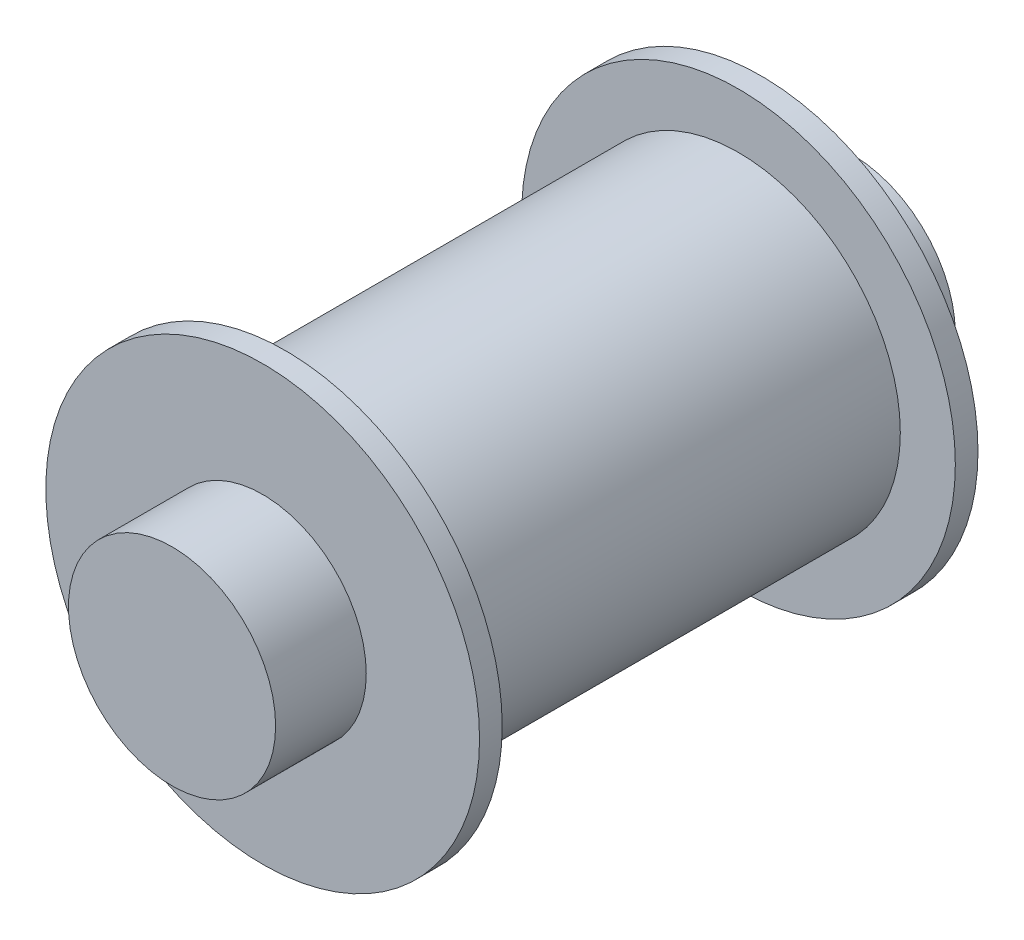
ISO-10303-21;
HEADER;
FILE_DESCRIPTION(('STEP AP214'),'2;1');
FILE_NAME('part.step','',(''),(''),'','','');
FILE_SCHEMA(('AUTOMOTIVE_DESIGN { 1 0 10303 214 1 1 1 1 }'));
ENDSEC;
DATA;
#1=APPLICATION_CONTEXT('core data for automotive mechanical design processes');
#2=APPLICATION_PROTOCOL_DEFINITION('international standard','automotive_design',2000,#1);
#3=PRODUCT_CONTEXT('',#1,'mechanical');
#4=PRODUCT('Part','Part','',(#3));
#5=PRODUCT_RELATED_PRODUCT_CATEGORY('part','',(#4));
#6=PRODUCT_DEFINITION_FORMATION('','',#4);
#7=PRODUCT_DEFINITION_CONTEXT('part definition',#1,'design');
#8=PRODUCT_DEFINITION('design','',#6,#7);
#9=PRODUCT_DEFINITION_SHAPE('','',#8);
#10=(LENGTH_UNIT() NAMED_UNIT(*) SI_UNIT(.MILLI.,.METRE.));
#11=(NAMED_UNIT(*) PLANE_ANGLE_UNIT() SI_UNIT($,.RADIAN.));
#12=(NAMED_UNIT(*) SI_UNIT($,.STERADIAN.) SOLID_ANGLE_UNIT());
#13=UNCERTAINTY_MEASURE_WITH_UNIT(LENGTH_MEASURE(1.E-05),#10,'distance_accuracy_value','');
#14=(GEOMETRIC_REPRESENTATION_CONTEXT(3) GLOBAL_UNCERTAINTY_ASSIGNED_CONTEXT((#13)) GLOBAL_UNIT_ASSIGNED_CONTEXT((#10,
#11,#12)) REPRESENTATION_CONTEXT('',''));
#15=CARTESIAN_POINT('',(0.,0.,0.));
#16=DIRECTION('',(0.,0.,1.));
#17=DIRECTION('',(1.,0.,0.));
#18=AXIS2_PLACEMENT_3D('',#15,#16,#17);
#19=CARTESIAN_POINT('',(0.,0.,52.5));
#20=DIRECTION('',(0.,0.,-1.));
#21=DIRECTION('',(-1.,0.,0.));
#22=AXIS2_PLACEMENT_3D('',#19,#20,#21);
#23=PLANE('',#22);
#24=CARTESIAN_POINT('',(0.,0.,52.5));
#25=DIRECTION('',(0.,0.,1.));
#26=DIRECTION('',(1.,0.,0.));
#27=AXIS2_PLACEMENT_3D('',#24,#25,#26);
#28=CIRCLE('',#27,16.);
#29=CARTESIAN_POINT('',(16.,0.,52.5));
#30=VERTEX_POINT('',#29);
#31=EDGE_CURVE('E68',#30,#30,#28,.T.);
#32=ORIENTED_EDGE('',*,*,#31,.T.);
#33=EDGE_LOOP('',(#32));
#34=FACE_BOUND('',#33,.T.);
#35=ADVANCED_FACE('F34',(#34),#23,.F.);
#36=CARTESIAN_POINT('',(0.,0.,-52.5));
#37=DIRECTION('',(0.,0.,1.));
#38=DIRECTION('',(1.,0.,0.));
#39=AXIS2_PLACEMENT_3D('',#36,#37,#38);
#40=PLANE('',#39);
#41=CARTESIAN_POINT('',(0.,0.,-52.5));
#42=DIRECTION('',(0.,0.,1.));
#43=DIRECTION('',(1.,0.,0.));
#44=AXIS2_PLACEMENT_3D('',#41,#42,#43);
#45=CIRCLE('',#44,16.);
#46=CARTESIAN_POINT('',(16.,0.,-52.5));
#47=VERTEX_POINT('',#46);
#48=EDGE_CURVE('E10',#47,#47,#45,.T.);
#49=ORIENTED_EDGE('',*,*,#48,.F.);
#50=EDGE_LOOP('',(#49));
#51=FACE_BOUND('',#50,.T.);
#52=ADVANCED_FACE('F122',(#51),#40,.F.);
#53=CARTESIAN_POINT('',(0.,0.,0.));
#54=DIRECTION('',(0.,0.,1.));
#55=DIRECTION('',(1.,0.,0.));
#56=AXIS2_PLACEMENT_3D('',#53,#54,#55);
#57=CYLINDRICAL_SURFACE('',#56,16.);
#58=CARTESIAN_POINT('',(0.,0.,-38.5));
#59=DIRECTION('',(0.,0.,1.));
#60=DIRECTION('',(1.,0.,0.));
#61=AXIS2_PLACEMENT_3D('',#58,#59,#60);
#62=CIRCLE('',#61,16.);
#63=CARTESIAN_POINT('',(16.,0.,-38.5));
#64=VERTEX_POINT('',#63);
#65=EDGE_CURVE('E40',#64,#64,#62,.T.);
#66=ORIENTED_EDGE('',*,*,#65,.F.);
#67=EDGE_LOOP('',(#66));
#68=FACE_BOUND('',#67,.T.);
#69=ORIENTED_EDGE('',*,*,#48,.T.);
#70=EDGE_LOOP('',(#69));
#71=FACE_BOUND('',#70,.T.);
#72=ADVANCED_FACE('F117',(#68,#71),#57,.T.);
#73=CARTESIAN_POINT('',(0.,16.,-38.5));
#74=DIRECTION('',(0.,0.,1.));
#75=DIRECTION('',(1.,0.,0.));
#76=AXIS2_PLACEMENT_3D('',#73,#74,#75);
#77=PLANE('',#76);
#78=CARTESIAN_POINT('',(0.,0.,-38.5));
#79=DIRECTION('',(0.,0.,1.));
#80=DIRECTION('',(1.,0.,0.));
#81=AXIS2_PLACEMENT_3D('',#78,#79,#80);
#82=CIRCLE('',#81,33.5);
#83=CARTESIAN_POINT('',(33.5,0.,-38.5));
#84=VERTEX_POINT('',#83);
#85=EDGE_CURVE('E44',#84,#84,#82,.T.);
#86=ORIENTED_EDGE('',*,*,#85,.F.);
#87=EDGE_LOOP('',(#86));
#88=FACE_BOUND('',#87,.T.);
#89=ORIENTED_EDGE('',*,*,#65,.T.);
#90=EDGE_LOOP('',(#89));
#91=FACE_BOUND('',#90,.T.);
#92=ADVANCED_FACE('F112',(#88,#91),#77,.F.);
#93=CARTESIAN_POINT('',(0.,0.,0.));
#94=DIRECTION('',(0.,0.,1.));
#95=DIRECTION('',(1.,0.,0.));
#96=AXIS2_PLACEMENT_3D('',#93,#94,#95);
#97=CYLINDRICAL_SURFACE('',#96,33.5);
#98=CARTESIAN_POINT('',(0.,0.,-35.));
#99=DIRECTION('',(0.,0.,1.));
#100=DIRECTION('',(1.,0.,0.));
#101=AXIS2_PLACEMENT_3D('',#98,#99,#100);
#102=CIRCLE('',#101,33.5);
#103=CARTESIAN_POINT('',(33.5,0.,-35.));
#104=VERTEX_POINT('',#103);
#105=EDGE_CURVE('E48',#104,#104,#102,.T.);
#106=ORIENTED_EDGE('',*,*,#105,.F.);
#107=EDGE_LOOP('',(#106));
#108=FACE_BOUND('',#107,.T.);
#109=ORIENTED_EDGE('',*,*,#85,.T.);
#110=EDGE_LOOP('',(#109));
#111=FACE_BOUND('',#110,.T.);
#112=ADVANCED_FACE('F106',(#108,#111),#97,.T.);
#113=CARTESIAN_POINT('',(0.,25.,-35.));
#114=DIRECTION('',(0.,0.,-1.));
#115=DIRECTION('',(-1.,0.,0.));
#116=AXIS2_PLACEMENT_3D('',#113,#114,#115);
#117=PLANE('',#116);
#118=CARTESIAN_POINT('',(0.,0.,-35.));
#119=DIRECTION('',(0.,0.,1.));
#120=DIRECTION('',(1.,0.,0.));
#121=AXIS2_PLACEMENT_3D('',#118,#119,#120);
#122=CIRCLE('',#121,25.);
#123=CARTESIAN_POINT('',(25.,0.,-35.));
#124=VERTEX_POINT('',#123);
#125=EDGE_CURVE('E53',#124,#124,#122,.T.);
#126=ORIENTED_EDGE('',*,*,#125,.F.);
#127=EDGE_LOOP('',(#126));
#128=FACE_BOUND('',#127,.T.);
#129=ORIENTED_EDGE('',*,*,#105,.T.);
#130=EDGE_LOOP('',(#129));
#131=FACE_BOUND('',#130,.T.);
#132=ADVANCED_FACE('F100',(#128,#131),#117,.F.);
#133=CARTESIAN_POINT('',(0.,0.,0.));
#134=DIRECTION('',(0.,0.,1.));
#135=DIRECTION('',(1.,0.,0.));
#136=AXIS2_PLACEMENT_3D('',#133,#134,#135);
#137=CYLINDRICAL_SURFACE('',#136,25.);
#138=CARTESIAN_POINT('',(0.,0.,35.));
#139=DIRECTION('',(0.,0.,1.));
#140=DIRECTION('',(1.,0.,0.));
#141=AXIS2_PLACEMENT_3D('',#138,#139,#140);
#142=CIRCLE('',#141,25.);
#143=CARTESIAN_POINT('',(25.,0.,35.));
#144=VERTEX_POINT('',#143);
#145=EDGE_CURVE('E56',#144,#144,#142,.T.);
#146=ORIENTED_EDGE('',*,*,#145,.F.);
#147=EDGE_LOOP('',(#146));
#148=FACE_BOUND('',#147,.T.);
#149=ORIENTED_EDGE('',*,*,#125,.T.);
#150=EDGE_LOOP('',(#149));
#151=FACE_BOUND('',#150,.T.);
#152=ADVANCED_FACE('F94',(#148,#151),#137,.T.);
#153=CARTESIAN_POINT('',(0.,33.5,35.));
#154=DIRECTION('',(0.,0.,1.));
#155=DIRECTION('',(1.,0.,0.));
#156=AXIS2_PLACEMENT_3D('',#153,#154,#155);
#157=PLANE('',#156);
#158=CARTESIAN_POINT('',(0.,0.,35.));
#159=DIRECTION('',(0.,0.,1.));
#160=DIRECTION('',(1.,0.,0.));
#161=AXIS2_PLACEMENT_3D('',#158,#159,#160);
#162=CIRCLE('',#161,33.5);
#163=CARTESIAN_POINT('',(33.5,0.,35.));
#164=VERTEX_POINT('',#163);
#165=EDGE_CURVE('E59',#164,#164,#162,.T.);
#166=ORIENTED_EDGE('',*,*,#165,.F.);
#167=EDGE_LOOP('',(#166));
#168=FACE_BOUND('',#167,.T.);
#169=ORIENTED_EDGE('',*,*,#145,.T.);
#170=EDGE_LOOP('',(#169));
#171=FACE_BOUND('',#170,.T.);
#172=ADVANCED_FACE('F88',(#168,#171),#157,.F.);
#173=CARTESIAN_POINT('',(0.,0.,0.));
#174=DIRECTION('',(0.,0.,1.));
#175=DIRECTION('',(1.,0.,0.));
#176=AXIS2_PLACEMENT_3D('',#173,#174,#175);
#177=CYLINDRICAL_SURFACE('',#176,33.5);
#178=CARTESIAN_POINT('',(0.,0.,38.5));
#179=DIRECTION('',(0.,0.,1.));
#180=DIRECTION('',(1.,0.,0.));
#181=AXIS2_PLACEMENT_3D('',#178,#179,#180);
#182=CIRCLE('',#181,33.5);
#183=CARTESIAN_POINT('',(33.5,0.,38.5));
#184=VERTEX_POINT('',#183);
#185=EDGE_CURVE('E62',#184,#184,#182,.T.);
#186=ORIENTED_EDGE('',*,*,#185,.F.);
#187=EDGE_LOOP('',(#186));
#188=FACE_BOUND('',#187,.T.);
#189=ORIENTED_EDGE('',*,*,#165,.T.);
#190=EDGE_LOOP('',(#189));
#191=FACE_BOUND('',#190,.T.);
#192=ADVANCED_FACE('F82',(#188,#191),#177,.T.);
#193=CARTESIAN_POINT('',(0.,16.,38.5));
#194=DIRECTION('',(0.,0.,-1.));
#195=DIRECTION('',(-1.,0.,0.));
#196=AXIS2_PLACEMENT_3D('',#193,#194,#195);
#197=PLANE('',#196);
#198=CARTESIAN_POINT('',(0.,0.,38.5));
#199=DIRECTION('',(0.,0.,1.));
#200=DIRECTION('',(1.,0.,0.));
#201=AXIS2_PLACEMENT_3D('',#198,#199,#200);
#202=CIRCLE('',#201,16.);
#203=CARTESIAN_POINT('',(16.,0.,38.5));
#204=VERTEX_POINT('',#203);
#205=EDGE_CURVE('E65',#204,#204,#202,.T.);
#206=ORIENTED_EDGE('',*,*,#205,.F.);
#207=EDGE_LOOP('',(#206));
#208=FACE_BOUND('',#207,.T.);
#209=ORIENTED_EDGE('',*,*,#185,.T.);
#210=EDGE_LOOP('',(#209));
#211=FACE_BOUND('',#210,.T.);
#212=ADVANCED_FACE('F76',(#208,#211),#197,.F.);
#213=CARTESIAN_POINT('',(0.,0.,0.));
#214=DIRECTION('',(0.,0.,1.));
#215=DIRECTION('',(1.,0.,0.));
#216=AXIS2_PLACEMENT_3D('',#213,#214,#215);
#217=CYLINDRICAL_SURFACE('',#216,16.);
#218=ORIENTED_EDGE('',*,*,#31,.F.);
#219=EDGE_LOOP('',(#218));
#220=FACE_BOUND('',#219,.T.);
#221=ORIENTED_EDGE('',*,*,#205,.T.);
#222=EDGE_LOOP('',(#221));
#223=FACE_BOUND('',#222,.T.);
#224=ADVANCED_FACE('F73',(#220,#223),#217,.T.);
#225=CLOSED_SHELL('',(#35,#52,#72,#92,#112,#132,#152,#172,#192,#212,#224));
#226=MANIFOLD_SOLID_BREP('B2',#225);
#227=ADVANCED_BREP_SHAPE_REPRESENTATION('',(#18,#226),#14);
#228=SHAPE_DEFINITION_REPRESENTATION(#9,#227);
ENDSEC;
END-ISO-10303-21;
